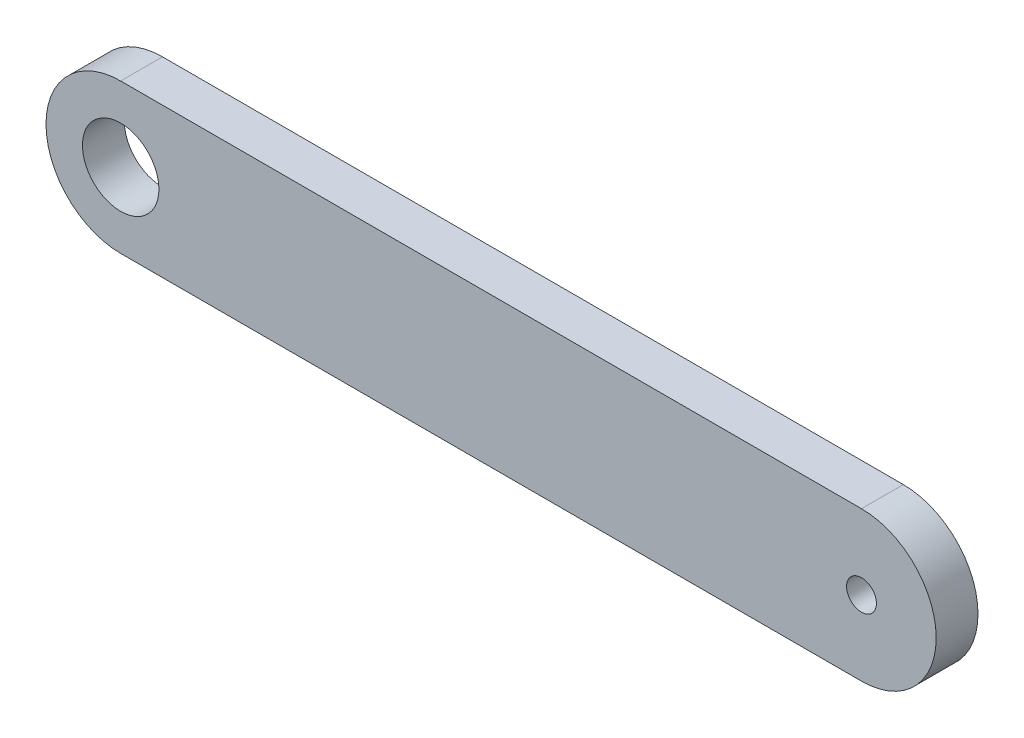
ISO-10303-21;
HEADER;
FILE_DESCRIPTION(('STEP AP214'),'2;1');
FILE_NAME('part.step','',(''),(''),'','','');
FILE_SCHEMA(('AUTOMOTIVE_DESIGN { 1 0 10303 214 1 1 1 1 }'));
ENDSEC;
DATA;
#1=APPLICATION_CONTEXT('core data for automotive mechanical design processes');
#2=APPLICATION_PROTOCOL_DEFINITION('international standard','automotive_design',2000,#1);
#3=PRODUCT_CONTEXT('',#1,'mechanical');
#4=PRODUCT('Part','Part','',(#3));
#5=PRODUCT_RELATED_PRODUCT_CATEGORY('part','',(#4));
#6=PRODUCT_DEFINITION_FORMATION('','',#4);
#7=PRODUCT_DEFINITION_CONTEXT('part definition',#1,'design');
#8=PRODUCT_DEFINITION('design','',#6,#7);
#9=PRODUCT_DEFINITION_SHAPE('','',#8);
#10=(LENGTH_UNIT() NAMED_UNIT(*) SI_UNIT(.MILLI.,.METRE.));
#11=(NAMED_UNIT(*) PLANE_ANGLE_UNIT() SI_UNIT($,.RADIAN.));
#12=(NAMED_UNIT(*) SI_UNIT($,.STERADIAN.) SOLID_ANGLE_UNIT());
#13=UNCERTAINTY_MEASURE_WITH_UNIT(LENGTH_MEASURE(1.E-05),#10,'distance_accuracy_value','');
#14=(GEOMETRIC_REPRESENTATION_CONTEXT(3) GLOBAL_UNCERTAINTY_ASSIGNED_CONTEXT((#13)) GLOBAL_UNIT_ASSIGNED_CONTEXT((#10,
#11,#12)) REPRESENTATION_CONTEXT('',''));
#15=CARTESIAN_POINT('',(0.,0.,0.));
#16=DIRECTION('',(0.,0.,1.));
#17=DIRECTION('',(1.,0.,0.));
#18=AXIS2_PLACEMENT_3D('',#15,#16,#17);
#19=CARTESIAN_POINT('',(0.,0.,1.75));
#20=DIRECTION('',(0.,0.,1.));
#21=DIRECTION('',(1.,0.,0.));
#22=AXIS2_PLACEMENT_3D('',#19,#20,#21);
#23=PLANE('',#22);
#24=CARTESIAN_POINT('',(0.,0.,1.75));
#25=DIRECTION('',(0.,0.,1.));
#26=DIRECTION('',(1.,0.,0.));
#27=AXIS2_PLACEMENT_3D('',#24,#25,#26);
#28=CIRCLE('',#27,1.6);
#29=CARTESIAN_POINT('',(1.6,0.,1.75));
#30=VERTEX_POINT('',#29);
#31=EDGE_CURVE('E100',#30,#30,#28,.T.);
#32=ORIENTED_EDGE('',*,*,#31,.F.);
#33=EDGE_LOOP('',(#32));
#34=FACE_BOUND('',#33,.T.);
#35=CARTESIAN_POINT('',(0.,0.,1.75));
#36=DIRECTION('',(0.,0.,1.));
#37=DIRECTION('',(1.,0.,0.));
#38=AXIS2_PLACEMENT_3D('',#35,#36,#37);
#39=CIRCLE('',#38,3.125);
#40=CARTESIAN_POINT('',(0.,3.125,1.75));
#41=VERTEX_POINT('',#40);
#42=CARTESIAN_POINT('',(0.,-3.125,1.75));
#43=VERTEX_POINT('',#42);
#44=EDGE_CURVE('E85',#41,#43,#39,.T.);
#45=ORIENTED_EDGE('',*,*,#44,.T.);
#46=DIRECTION('',(1.,0.,0.));
#47=VECTOR('',#46,1.);
#48=CARTESIAN_POINT('',(0.,-3.125,1.75));
#49=LINE('',#48,#47);
#50=CARTESIAN_POINT('',(31.,-3.125,1.75));
#51=VERTEX_POINT('',#50);
#52=EDGE_CURVE('E80',#43,#51,#49,.T.);
#53=ORIENTED_EDGE('',*,*,#52,.T.);
#54=CARTESIAN_POINT('',(31.,0.,1.75));
#55=DIRECTION('',(0.,0.,1.));
#56=DIRECTION('',(1.,0.,0.));
#57=AXIS2_PLACEMENT_3D('',#54,#55,#56);
#58=CIRCLE('',#57,3.125);
#59=CARTESIAN_POINT('',(31.,3.125,1.75));
#60=VERTEX_POINT('',#59);
#61=EDGE_CURVE('E83',#51,#60,#58,.T.);
#62=ORIENTED_EDGE('',*,*,#61,.T.);
#63=DIRECTION('',(-1.,0.,0.));
#64=VECTOR('',#63,1.);
#65=CARTESIAN_POINT('',(0.,3.125,1.75));
#66=LINE('',#65,#64);
#67=EDGE_CURVE('E50',#60,#41,#66,.T.);
#68=ORIENTED_EDGE('',*,*,#67,.T.);
#69=EDGE_LOOP('',(#45,#53,#62,#68));
#70=FACE_BOUND('',#69,.T.);
#71=CARTESIAN_POINT('',(31.,0.,1.75));
#72=DIRECTION('',(0.,0.,1.));
#73=DIRECTION('',(1.,0.,0.));
#74=AXIS2_PLACEMENT_3D('',#71,#72,#73);
#75=CIRCLE('',#74,0.624999999999999);
#76=CARTESIAN_POINT('',(31.625,0.,1.75));
#77=VERTEX_POINT('',#76);
#78=EDGE_CURVE('E115',#77,#77,#75,.T.);
#79=ORIENTED_EDGE('',*,*,#78,.F.);
#80=EDGE_LOOP('',(#79));
#81=FACE_BOUND('',#80,.T.);
#82=ADVANCED_FACE('F33',(#34,#70,#81),#23,.T.);
#83=CARTESIAN_POINT('',(0.,0.,0.));
#84=DIRECTION('',(0.,0.,1.));
#85=DIRECTION('',(1.,0.,0.));
#86=AXIS2_PLACEMENT_3D('',#83,#84,#85);
#87=PLANE('',#86);
#88=CARTESIAN_POINT('',(0.,0.,0.));
#89=DIRECTION('',(0.,0.,1.));
#90=DIRECTION('',(1.,0.,0.));
#91=AXIS2_PLACEMENT_3D('',#88,#89,#90);
#92=CIRCLE('',#91,3.125);
#93=CARTESIAN_POINT('',(0.,3.125,0.));
#94=VERTEX_POINT('',#93);
#95=CARTESIAN_POINT('',(0.,-3.125,0.));
#96=VERTEX_POINT('',#95);
#97=EDGE_CURVE('E97',#94,#96,#92,.T.);
#98=ORIENTED_EDGE('',*,*,#97,.F.);
#99=DIRECTION('',(-1.,0.,0.));
#100=VECTOR('',#99,1.);
#101=CARTESIAN_POINT('',(0.,3.125,0.));
#102=LINE('',#101,#100);
#103=CARTESIAN_POINT('',(31.,3.125,0.));
#104=VERTEX_POINT('',#103);
#105=EDGE_CURVE('E73',#104,#94,#102,.T.);
#106=ORIENTED_EDGE('',*,*,#105,.F.);
#107=CARTESIAN_POINT('',(31.,0.,0.));
#108=DIRECTION('',(0.,0.,1.));
#109=DIRECTION('',(1.,0.,0.));
#110=AXIS2_PLACEMENT_3D('',#107,#108,#109);
#111=CIRCLE('',#110,3.125);
#112=CARTESIAN_POINT('',(31.,-3.125,0.));
#113=VERTEX_POINT('',#112);
#114=EDGE_CURVE('E67',#113,#104,#111,.T.);
#115=ORIENTED_EDGE('',*,*,#114,.F.);
#116=DIRECTION('',(1.,0.,0.));
#117=VECTOR('',#116,1.);
#118=CARTESIAN_POINT('',(0.,-3.125,0.));
#119=LINE('',#118,#117);
#120=EDGE_CURVE('E89',#96,#113,#119,.T.);
#121=ORIENTED_EDGE('',*,*,#120,.F.);
#122=EDGE_LOOP('',(#98,#106,#115,#121));
#123=FACE_BOUND('',#122,.T.);
#124=CARTESIAN_POINT('',(0.,0.,0.));
#125=DIRECTION('',(0.,0.,1.));
#126=DIRECTION('',(1.,0.,0.));
#127=AXIS2_PLACEMENT_3D('',#124,#125,#126);
#128=CIRCLE('',#127,1.6);
#129=CARTESIAN_POINT('',(1.6,0.,0.));
#130=VERTEX_POINT('',#129);
#131=EDGE_CURVE('E112',#130,#130,#128,.T.);
#132=ORIENTED_EDGE('',*,*,#131,.T.);
#133=EDGE_LOOP('',(#132));
#134=FACE_BOUND('',#133,.T.);
#135=CARTESIAN_POINT('',(31.,0.,0.));
#136=DIRECTION('',(0.,0.,1.));
#137=DIRECTION('',(1.,0.,0.));
#138=AXIS2_PLACEMENT_3D('',#135,#136,#137);
#139=CIRCLE('',#138,0.624999999999999);
#140=CARTESIAN_POINT('',(31.625,0.,0.));
#141=VERTEX_POINT('',#140);
#142=EDGE_CURVE('E118',#141,#141,#139,.T.);
#143=ORIENTED_EDGE('',*,*,#142,.T.);
#144=EDGE_LOOP('',(#143));
#145=FACE_BOUND('',#144,.T.);
#146=ADVANCED_FACE('F108',(#123,#134,#145),#87,.F.);
#147=CARTESIAN_POINT('',(0.,0.,1.75));
#148=DIRECTION('',(0.,0.,-1.));
#149=DIRECTION('',(-1.,0.,0.));
#150=AXIS2_PLACEMENT_3D('',#147,#148,#149);
#151=CYLINDRICAL_SURFACE('',#150,3.125);
#152=ORIENTED_EDGE('',*,*,#97,.T.);
#153=DIRECTION('',(0.,0.,-1.));
#154=VECTOR('',#153,1.);
#155=CARTESIAN_POINT('',(0.,-3.125,1.75));
#156=LINE('',#155,#154);
#157=EDGE_CURVE('E11',#43,#96,#156,.T.);
#158=ORIENTED_EDGE('',*,*,#157,.F.);
#159=ORIENTED_EDGE('',*,*,#44,.F.);
#160=DIRECTION('',(0.,0.,-1.));
#161=VECTOR('',#160,1.);
#162=CARTESIAN_POINT('',(0.,3.125,1.75));
#163=LINE('',#162,#161);
#164=EDGE_CURVE('E93',#41,#94,#163,.T.);
#165=ORIENTED_EDGE('',*,*,#164,.T.);
#166=EDGE_LOOP('',(#152,#158,#159,#165));
#167=FACE_BOUND('',#166,.T.);
#168=ADVANCED_FACE('F35',(#167),#151,.T.);
#169=CARTESIAN_POINT('',(0.,-3.125,1.75));
#170=DIRECTION('',(0.,1.,0.));
#171=DIRECTION('',(0.,0.,1.));
#172=AXIS2_PLACEMENT_3D('',#169,#170,#171);
#173=PLANE('',#172);
#174=ORIENTED_EDGE('',*,*,#120,.T.);
#175=DIRECTION('',(0.,0.,-1.));
#176=VECTOR('',#175,1.);
#177=CARTESIAN_POINT('',(31.,-3.125,1.75));
#178=LINE('',#177,#176);
#179=EDGE_CURVE('E42',#51,#113,#178,.T.);
#180=ORIENTED_EDGE('',*,*,#179,.F.);
#181=ORIENTED_EDGE('',*,*,#52,.F.);
#182=ORIENTED_EDGE('',*,*,#157,.T.);
#183=EDGE_LOOP('',(#174,#180,#181,#182));
#184=FACE_BOUND('',#183,.T.);
#185=ADVANCED_FACE('F88',(#184),#173,.F.);
#186=CARTESIAN_POINT('',(31.,0.,1.75));
#187=DIRECTION('',(0.,0.,-1.));
#188=DIRECTION('',(-1.,0.,0.));
#189=AXIS2_PLACEMENT_3D('',#186,#187,#188);
#190=CYLINDRICAL_SURFACE('',#189,3.125);
#191=ORIENTED_EDGE('',*,*,#114,.T.);
#192=DIRECTION('',(0.,0.,-1.));
#193=VECTOR('',#192,1.);
#194=CARTESIAN_POINT('',(31.,3.125,1.75));
#195=LINE('',#194,#193);
#196=EDGE_CURVE('E90',#60,#104,#195,.T.);
#197=ORIENTED_EDGE('',*,*,#196,.F.);
#198=ORIENTED_EDGE('',*,*,#61,.F.);
#199=ORIENTED_EDGE('',*,*,#179,.T.);
#200=EDGE_LOOP('',(#191,#197,#198,#199));
#201=FACE_BOUND('',#200,.T.);
#202=ADVANCED_FACE('F91',(#201),#190,.T.);
#203=CARTESIAN_POINT('',(0.,3.125,1.75));
#204=DIRECTION('',(0.,-1.,0.));
#205=DIRECTION('',(0.,0.,-1.));
#206=AXIS2_PLACEMENT_3D('',#203,#204,#205);
#207=PLANE('',#206);
#208=ORIENTED_EDGE('',*,*,#105,.T.);
#209=ORIENTED_EDGE('',*,*,#164,.F.);
#210=ORIENTED_EDGE('',*,*,#67,.F.);
#211=ORIENTED_EDGE('',*,*,#196,.T.);
#212=EDGE_LOOP('',(#208,#209,#210,#211));
#213=FACE_BOUND('',#212,.T.);
#214=ADVANCED_FACE('F105',(#213),#207,.F.);
#215=CARTESIAN_POINT('',(0.,0.,1.75));
#216=DIRECTION('',(0.,0.,-1.));
#217=DIRECTION('',(-1.,0.,0.));
#218=AXIS2_PLACEMENT_3D('',#215,#216,#217);
#219=CYLINDRICAL_SURFACE('',#218,1.6);
#220=ORIENTED_EDGE('',*,*,#31,.T.);
#221=EDGE_LOOP('',(#220));
#222=FACE_BOUND('',#221,.T.);
#223=ORIENTED_EDGE('',*,*,#131,.F.);
#224=EDGE_LOOP('',(#223));
#225=FACE_BOUND('',#224,.T.);
#226=ADVANCED_FACE('F135',(#222,#225),#219,.F.);
#227=CARTESIAN_POINT('',(31.,0.,1.75));
#228=DIRECTION('',(0.,0.,-1.));
#229=DIRECTION('',(-1.,0.,0.));
#230=AXIS2_PLACEMENT_3D('',#227,#228,#229);
#231=CYLINDRICAL_SURFACE('',#230,0.624999999999999);
#232=ORIENTED_EDGE('',*,*,#78,.T.);
#233=EDGE_LOOP('',(#232));
#234=FACE_BOUND('',#233,.T.);
#235=ORIENTED_EDGE('',*,*,#142,.F.);
#236=EDGE_LOOP('',(#235));
#237=FACE_BOUND('',#236,.T.);
#238=ADVANCED_FACE('F124',(#234,#237),#231,.F.);
#239=CLOSED_SHELL('',(#82,#146,#168,#185,#202,#214,#226,#238));
#240=MANIFOLD_SOLID_BREP('B2',#239);
#241=ADVANCED_BREP_SHAPE_REPRESENTATION('',(#18,#240),#14);
#242=SHAPE_DEFINITION_REPRESENTATION(#9,#241);
ENDSEC;
END-ISO-10303-21;
